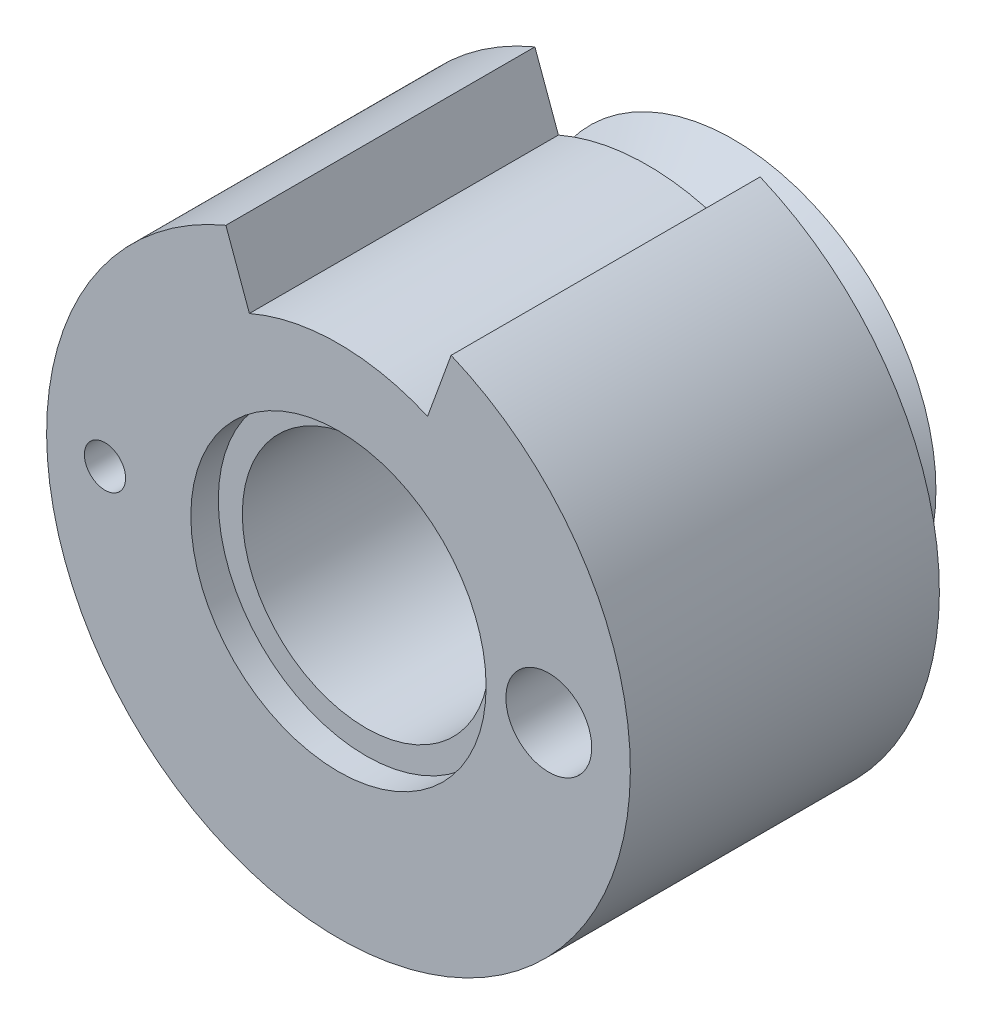
ISO-10303-21;
HEADER;
FILE_DESCRIPTION(('STEP AP214'),'2;1');
FILE_NAME('part.step','',(''),(''),'','','');
FILE_SCHEMA(('AUTOMOTIVE_DESIGN { 1 0 10303 214 1 1 1 1 }'));
ENDSEC;
DATA;
#1=APPLICATION_CONTEXT('core data for automotive mechanical design processes');
#2=APPLICATION_PROTOCOL_DEFINITION('international standard','automotive_design',2000,#1);
#3=PRODUCT_CONTEXT('',#1,'mechanical');
#4=PRODUCT('Part','Part','',(#3));
#5=PRODUCT_RELATED_PRODUCT_CATEGORY('part','',(#4));
#6=PRODUCT_DEFINITION_FORMATION('','',#4);
#7=PRODUCT_DEFINITION_CONTEXT('part definition',#1,'design');
#8=PRODUCT_DEFINITION('design','',#6,#7);
#9=PRODUCT_DEFINITION_SHAPE('','',#8);
#10=(LENGTH_UNIT() NAMED_UNIT(*) SI_UNIT(.MILLI.,.METRE.));
#11=(NAMED_UNIT(*) PLANE_ANGLE_UNIT() SI_UNIT($,.RADIAN.));
#12=(NAMED_UNIT(*) SI_UNIT($,.STERADIAN.) SOLID_ANGLE_UNIT());
#13=UNCERTAINTY_MEASURE_WITH_UNIT(LENGTH_MEASURE(1.E-05),#10,'distance_accuracy_value','');
#14=(GEOMETRIC_REPRESENTATION_CONTEXT(3) GLOBAL_UNCERTAINTY_ASSIGNED_CONTEXT((#13)) GLOBAL_UNIT_ASSIGNED_CONTEXT((#10,
#11,#12)) REPRESENTATION_CONTEXT('',''));
#15=CARTESIAN_POINT('',(0.,0.,0.));
#16=DIRECTION('',(0.,0.,1.));
#17=DIRECTION('',(1.,0.,0.));
#18=AXIS2_PLACEMENT_3D('',#15,#16,#17);
#19=CARTESIAN_POINT('',(0.,0.,0.));
#20=DIRECTION('',(0.,0.,1.));
#21=DIRECTION('',(1.,0.,0.));
#22=AXIS2_PLACEMENT_3D('',#19,#20,#21);
#23=PLANE('',#22);
#24=CARTESIAN_POINT('',(-6.8,0.,0.));
#25=DIRECTION('',(0.,0.,1.));
#26=DIRECTION('',(1.,0.,0.));
#27=AXIS2_PLACEMENT_3D('',#24,#25,#26);
#28=CIRCLE('',#27,0.6);
#29=CARTESIAN_POINT('',(-6.2,0.,0.));
#30=VERTEX_POINT('',#29);
#31=EDGE_CURVE('E136',#30,#30,#28,.T.);
#32=ORIENTED_EDGE('',*,*,#31,.T.);
#33=EDGE_LOOP('',(#32));
#34=FACE_BOUND('',#33,.T.);
#35=CARTESIAN_POINT('',(0.,0.,0.));
#36=DIRECTION('',(0.,0.,-1.));
#37=DIRECTION('',(-1.,0.,0.));
#38=AXIS2_PLACEMENT_3D('',#35,#36,#37);
#39=CIRCLE('',#38,5.9);
#40=CARTESIAN_POINT('',(5.77658163265306,-1.20046017897109,0.));
#41=VERTEX_POINT('',#40);
#42=CARTESIAN_POINT('',(5.77658163265306,1.20046017897109,0.));
#43=VERTEX_POINT('',#42);
#44=EDGE_CURVE('E54',#41,#43,#39,.T.);
#45=ORIENTED_EDGE('',*,*,#44,.F.);
#46=CARTESIAN_POINT('',(6.125,0.,0.));
#47=DIRECTION('',(0.,0.,1.));
#48=DIRECTION('',(1.,0.,0.));
#49=AXIS2_PLACEMENT_3D('',#46,#47,#48);
#50=CIRCLE('',#49,1.25);
#51=EDGE_CURVE('E135',#41,#43,#50,.T.);
#52=ORIENTED_EDGE('',*,*,#51,.T.);
#53=EDGE_LOOP('',(#45,#52));
#54=FACE_BOUND('',#53,.T.);
#55=CARTESIAN_POINT('',(0.,0.,0.));
#56=DIRECTION('',(0.,0.,1.));
#57=DIRECTION('',(1.,0.,0.));
#58=AXIS2_PLACEMENT_3D('',#55,#56,#57);
#59=CIRCLE('',#58,8.5);
#60=CARTESIAN_POINT('',(-3.27982746934026,7.8417301516541,0.));
#61=VERTEX_POINT('',#60);
#62=CARTESIAN_POINT('',(3.27982746934026,7.8417301516541,0.));
#63=VERTEX_POINT('',#62);
#64=EDGE_CURVE('E142',#61,#63,#59,.T.);
#65=ORIENTED_EDGE('',*,*,#64,.F.);
#66=DIRECTION('',(0.34202014332567,-0.939692620785908,0.));
#67=VECTOR('',#66,1.);
#68=CARTESIAN_POINT('',(-0.375877048314356,-0.136808057330266,0.));
#69=LINE('',#68,#67);
#70=CARTESIAN_POINT('',(-2.59479450837481,5.95961755981942,0.));
#71=VERTEX_POINT('',#70);
#72=EDGE_CURVE('E105',#61,#71,#69,.T.);
#73=ORIENTED_EDGE('',*,*,#72,.T.);
#74=CARTESIAN_POINT('',(0.,0.,0.));
#75=DIRECTION('',(0.,0.,1.));
#76=DIRECTION('',(1.,0.,0.));
#77=AXIS2_PLACEMENT_3D('',#74,#75,#76);
#78=CIRCLE('',#77,6.5);
#79=CARTESIAN_POINT('',(2.59479450837481,5.95961755981941,0.));
#80=VERTEX_POINT('',#79);
#81=EDGE_CURVE('E108',#71,#80,#78,.F.);
#82=ORIENTED_EDGE('',*,*,#81,.T.);
#83=DIRECTION('',(0.342020143325669,0.939692620785908,0.));
#84=VECTOR('',#83,1.);
#85=CARTESIAN_POINT('',(0.375877048314363,-0.136808057330268,0.));
#86=LINE('',#85,#84);
#87=EDGE_CURVE('E81',#80,#63,#86,.T.);
#88=ORIENTED_EDGE('',*,*,#87,.T.);
#89=EDGE_LOOP('',(#65,#73,#82,#88));
#90=FACE_BOUND('',#89,.T.);
#91=ADVANCED_FACE('F32',(#34,#54,#90),#23,.F.);
#92=CARTESIAN_POINT('',(0.,0.,9.));
#93=DIRECTION('',(0.,0.,-1.));
#94=DIRECTION('',(-1.,0.,0.));
#95=AXIS2_PLACEMENT_3D('',#92,#93,#94);
#96=CYLINDRICAL_SURFACE('',#95,3.6);
#97=CARTESIAN_POINT('',(0.,0.,8.2));
#98=DIRECTION('',(0.,0.,1.));
#99=DIRECTION('',(1.,0.,0.));
#100=AXIS2_PLACEMENT_3D('',#97,#98,#99);
#101=CIRCLE('',#100,3.6);
#102=CARTESIAN_POINT('',(3.6,0.,8.2));
#103=VERTEX_POINT('',#102);
#104=EDGE_CURVE('E129',#103,#103,#101,.T.);
#105=ORIENTED_EDGE('',*,*,#104,.T.);
#106=EDGE_LOOP('',(#105));
#107=FACE_BOUND('',#106,.T.);
#108=CARTESIAN_POINT('',(0.,0.,-1.7));
#109=DIRECTION('',(0.,0.,-1.));
#110=DIRECTION('',(-1.,0.,0.));
#111=AXIS2_PLACEMENT_3D('',#108,#109,#110);
#112=CIRCLE('',#111,3.6);
#113=CARTESIAN_POINT('',(-3.6,0.,-1.7));
#114=VERTEX_POINT('',#113);
#115=EDGE_CURVE('E114',#114,#114,#112,.T.);
#116=ORIENTED_EDGE('',*,*,#115,.T.);
#117=EDGE_LOOP('',(#116));
#118=FACE_BOUND('',#117,.T.);
#119=ADVANCED_FACE('F167',(#107,#118),#96,.F.);
#120=CARTESIAN_POINT('',(0.,0.,9.));
#121=DIRECTION('',(0.,0.,1.));
#122=DIRECTION('',(1.,0.,0.));
#123=AXIS2_PLACEMENT_3D('',#120,#121,#122);
#124=PLANE('',#123);
#125=DIRECTION('',(-0.34202014332567,0.939692620785908,0.));
#126=VECTOR('',#125,1.);
#127=CARTESIAN_POINT('',(-2.59479450837481,5.95961755981942,9.));
#128=LINE('',#127,#126);
#129=CARTESIAN_POINT('',(-2.59479450837481,5.95961755981942,9.));
#130=VERTEX_POINT('',#129);
#131=CARTESIAN_POINT('',(-3.27982746934026,7.8417301516541,9.));
#132=VERTEX_POINT('',#131);
#133=EDGE_CURVE('E85',#130,#132,#128,.T.);
#134=ORIENTED_EDGE('',*,*,#133,.T.);
#135=CARTESIAN_POINT('',(0.,0.,9.));
#136=DIRECTION('',(0.,0.,1.));
#137=DIRECTION('',(1.,0.,0.));
#138=AXIS2_PLACEMENT_3D('',#135,#136,#137);
#139=CIRCLE('',#138,8.5);
#140=CARTESIAN_POINT('',(3.27982746934026,7.8417301516541,9.));
#141=VERTEX_POINT('',#140);
#142=EDGE_CURVE('E99',#132,#141,#139,.T.);
#143=ORIENTED_EDGE('',*,*,#142,.T.);
#144=DIRECTION('',(-0.342020143325669,-0.939692620785908,0.));
#145=VECTOR('',#144,1.);
#146=CARTESIAN_POINT('',(3.41678043147576,8.21800532264882,9.));
#147=LINE('',#146,#145);
#148=CARTESIAN_POINT('',(2.59479450837481,5.95961755981941,9.));
#149=VERTEX_POINT('',#148);
#150=EDGE_CURVE('E47',#141,#149,#147,.T.);
#151=ORIENTED_EDGE('',*,*,#150,.T.);
#152=CARTESIAN_POINT('',(0.,0.,9.));
#153=DIRECTION('',(0.,0.,1.));
#154=DIRECTION('',(-1.,0.,0.));
#155=AXIS2_PLACEMENT_3D('',#152,#153,#154);
#156=CIRCLE('',#155,6.5);
#157=EDGE_CURVE('E88',#149,#130,#156,.T.);
#158=ORIENTED_EDGE('',*,*,#157,.T.);
#159=EDGE_LOOP('',(#134,#143,#151,#158));
#160=FACE_BOUND('',#159,.T.);
#161=CARTESIAN_POINT('',(0.,0.,9.));
#162=DIRECTION('',(0.,0.,1.));
#163=DIRECTION('',(1.,0.,0.));
#164=AXIS2_PLACEMENT_3D('',#161,#162,#163);
#165=CIRCLE('',#164,4.3);
#166=CARTESIAN_POINT('',(4.3,0.,9.));
#167=VERTEX_POINT('',#166);
#168=EDGE_CURVE('E125',#167,#167,#165,.T.);
#169=ORIENTED_EDGE('',*,*,#168,.F.);
#170=EDGE_LOOP('',(#169));
#171=FACE_BOUND('',#170,.T.);
#172=CARTESIAN_POINT('',(6.125,0.,9.));
#173=DIRECTION('',(0.,0.,1.));
#174=DIRECTION('',(1.,0.,0.));
#175=AXIS2_PLACEMENT_3D('',#172,#173,#174);
#176=CIRCLE('',#175,1.25);
#177=CARTESIAN_POINT('',(7.375,0.,9.));
#178=VERTEX_POINT('',#177);
#179=EDGE_CURVE('E139',#178,#178,#176,.T.);
#180=ORIENTED_EDGE('',*,*,#179,.F.);
#181=EDGE_LOOP('',(#180));
#182=FACE_BOUND('',#181,.T.);
#183=CARTESIAN_POINT('',(-6.8,0.,9.));
#184=DIRECTION('',(0.,0.,1.));
#185=DIRECTION('',(1.,0.,0.));
#186=AXIS2_PLACEMENT_3D('',#183,#184,#185);
#187=CIRCLE('',#186,0.6);
#188=CARTESIAN_POINT('',(-6.2,0.,9.));
#189=VERTEX_POINT('',#188);
#190=EDGE_CURVE('E132',#189,#189,#187,.T.);
#191=ORIENTED_EDGE('',*,*,#190,.F.);
#192=EDGE_LOOP('',(#191));
#193=FACE_BOUND('',#192,.T.);
#194=ADVANCED_FACE('F96',(#160,#171,#182,#193),#124,.T.);
#195=CARTESIAN_POINT('',(0.,0.,9.));
#196=DIRECTION('',(0.,0.,-1.));
#197=DIRECTION('',(-1.,0.,0.));
#198=AXIS2_PLACEMENT_3D('',#195,#196,#197);
#199=CYLINDRICAL_SURFACE('',#198,8.5);
#200=ORIENTED_EDGE('',*,*,#142,.F.);
#201=DIRECTION('',(0.,0.,-1.));
#202=VECTOR('',#201,1.);
#203=CARTESIAN_POINT('',(-3.27982746934026,7.8417301516541,9.));
#204=LINE('',#203,#202);
#205=EDGE_CURVE('E11',#132,#61,#204,.T.);
#206=ORIENTED_EDGE('',*,*,#205,.T.);
#207=ORIENTED_EDGE('',*,*,#64,.T.);
#208=DIRECTION('',(0.,0.,-1.));
#209=VECTOR('',#208,1.);
#210=CARTESIAN_POINT('',(3.27982746934026,7.8417301516541,9.));
#211=LINE('',#210,#209);
#212=EDGE_CURVE('E40',#63,#141,#211,.F.);
#213=ORIENTED_EDGE('',*,*,#212,.T.);
#214=EDGE_LOOP('',(#200,#206,#207,#213));
#215=FACE_BOUND('',#214,.T.);
#216=ADVANCED_FACE('F34',(#215),#199,.T.);
#217=CARTESIAN_POINT('',(6.125,0.,9.));
#218=DIRECTION('',(0.,0.,-1.));
#219=DIRECTION('',(-1.,0.,0.));
#220=AXIS2_PLACEMENT_3D('',#217,#218,#219);
#221=CYLINDRICAL_SURFACE('',#220,1.25);
#222=ORIENTED_EDGE('',*,*,#179,.T.);
#223=EDGE_LOOP('',(#222));
#224=FACE_BOUND('',#223,.T.);
#225=EDGE_CURVE('E143',#43,#41,#50,.T.);
#226=ORIENTED_EDGE('',*,*,#225,.F.);
#227=ORIENTED_EDGE('',*,*,#51,.F.);
#228=EDGE_LOOP('',(#226,#227));
#229=FACE_BOUND('',#228,.T.);
#230=ADVANCED_FACE('F178',(#224,#229),#221,.F.);
#231=CARTESIAN_POINT('',(-6.8,0.,9.));
#232=DIRECTION('',(0.,0.,-1.));
#233=DIRECTION('',(-1.,0.,0.));
#234=AXIS2_PLACEMENT_3D('',#231,#232,#233);
#235=CYLINDRICAL_SURFACE('',#234,0.6);
#236=ORIENTED_EDGE('',*,*,#190,.T.);
#237=EDGE_LOOP('',(#236));
#238=FACE_BOUND('',#237,.T.);
#239=ORIENTED_EDGE('',*,*,#31,.F.);
#240=EDGE_LOOP('',(#239));
#241=FACE_BOUND('',#240,.T.);
#242=ADVANCED_FACE('F181',(#238,#241),#235,.F.);
#243=CARTESIAN_POINT('',(0.,0.,8.2));
#244=DIRECTION('',(0.,0.,1.));
#245=DIRECTION('',(1.,0.,0.));
#246=AXIS2_PLACEMENT_3D('',#243,#244,#245);
#247=CYLINDRICAL_SURFACE('',#246,4.3);
#248=CARTESIAN_POINT('',(0.,0.,8.2));
#249=DIRECTION('',(0.,0.,1.));
#250=DIRECTION('',(1.,0.,0.));
#251=AXIS2_PLACEMENT_3D('',#248,#249,#250);
#252=CIRCLE('',#251,4.3);
#253=CARTESIAN_POINT('',(4.3,0.,8.2));
#254=VERTEX_POINT('',#253);
#255=EDGE_CURVE('E126',#254,#254,#252,.T.);
#256=ORIENTED_EDGE('',*,*,#255,.F.);
#257=EDGE_LOOP('',(#256));
#258=FACE_BOUND('',#257,.T.);
#259=ORIENTED_EDGE('',*,*,#168,.T.);
#260=EDGE_LOOP('',(#259));
#261=FACE_BOUND('',#260,.T.);
#262=ADVANCED_FACE('F185',(#258,#261),#247,.F.);
#263=CARTESIAN_POINT('',(0.,0.,8.2));
#264=DIRECTION('',(0.,0.,1.));
#265=DIRECTION('',(1.,0.,0.));
#266=AXIS2_PLACEMENT_3D('',#263,#264,#265);
#267=PLANE('',#266);
#268=ORIENTED_EDGE('',*,*,#104,.F.);
#269=EDGE_LOOP('',(#268));
#270=FACE_BOUND('',#269,.T.);
#271=ORIENTED_EDGE('',*,*,#255,.T.);
#272=EDGE_LOOP('',(#271));
#273=FACE_BOUND('',#272,.T.);
#274=ADVANCED_FACE('F189',(#270,#273),#267,.T.);
#275=CARTESIAN_POINT('',(0.,0.,0.));
#276=DIRECTION('',(0.,0.,-1.));
#277=DIRECTION('',(-1.,0.,0.));
#278=AXIS2_PLACEMENT_3D('',#275,#276,#277);
#279=PLANE('',#278);
#280=EDGE_CURVE('E123',#43,#41,#39,.T.);
#281=ORIENTED_EDGE('',*,*,#280,.F.);
#282=ORIENTED_EDGE('',*,*,#225,.T.);
#283=EDGE_LOOP('',(#281,#282));
#284=FACE_BOUND('',#283,.T.);
#285=ADVANCED_FACE('F193',(#284),#279,.F.);
#286=CARTESIAN_POINT('',(0.,0.,-2.5));
#287=DIRECTION('',(0.,0.,-1.));
#288=DIRECTION('',(-1.,0.,0.));
#289=AXIS2_PLACEMENT_3D('',#286,#287,#288);
#290=PLANE('',#289);
#291=CARTESIAN_POINT('',(0.,0.,-2.5));
#292=DIRECTION('',(0.,0.,-1.));
#293=DIRECTION('',(-1.,0.,0.));
#294=AXIS2_PLACEMENT_3D('',#291,#292,#293);
#295=CIRCLE('',#294,4.3);
#296=CARTESIAN_POINT('',(-4.3,0.,-2.5));
#297=VERTEX_POINT('',#296);
#298=EDGE_CURVE('E110',#297,#297,#295,.T.);
#299=ORIENTED_EDGE('',*,*,#298,.F.);
#300=EDGE_LOOP('',(#299));
#301=FACE_BOUND('',#300,.T.);
#302=CARTESIAN_POINT('',(0.,0.,-2.5));
#303=DIRECTION('',(0.,0.,1.));
#304=DIRECTION('',(1.,0.,0.));
#305=AXIS2_PLACEMENT_3D('',#302,#303,#304);
#306=CIRCLE('',#305,5.9);
#307=CARTESIAN_POINT('',(5.9,0.,-2.5));
#308=VERTEX_POINT('',#307);
#309=EDGE_CURVE('E117',#308,#308,#306,.T.);
#310=ORIENTED_EDGE('',*,*,#309,.F.);
#311=EDGE_LOOP('',(#310));
#312=FACE_BOUND('',#311,.T.);
#313=ADVANCED_FACE('F197',(#301,#312),#290,.T.);
#314=CARTESIAN_POINT('',(0.,0.,-1.25));
#315=DIRECTION('',(0.,0.,-1.));
#316=DIRECTION('',(-1.,0.,0.));
#317=AXIS2_PLACEMENT_3D('',#314,#315,#316);
#318=CONICAL_SURFACE('',#317,4.6,0.805003494254653);
#319=ORIENTED_EDGE('',*,*,#309,.T.);
#320=EDGE_LOOP('',(#319));
#321=FACE_BOUND('',#320,.T.);
#322=CARTESIAN_POINT('',(0.,0.,-1.25));
#323=DIRECTION('',(0.,0.,1.));
#324=DIRECTION('',(1.,0.,0.));
#325=AXIS2_PLACEMENT_3D('',#322,#323,#324);
#326=CIRCLE('',#325,4.6);
#327=CARTESIAN_POINT('',(4.6,0.,-1.25));
#328=VERTEX_POINT('',#327);
#329=EDGE_CURVE('E120',#328,#328,#326,.T.);
#330=ORIENTED_EDGE('',*,*,#329,.F.);
#331=EDGE_LOOP('',(#330));
#332=FACE_BOUND('',#331,.T.);
#333=ADVANCED_FACE('F201',(#321,#332),#318,.T.);
#334=CARTESIAN_POINT('',(0.,0.,0.));
#335=DIRECTION('',(0.,0.,1.));
#336=DIRECTION('',(1.,0.,0.));
#337=AXIS2_PLACEMENT_3D('',#334,#335,#336);
#338=CONICAL_SURFACE('',#337,5.9,0.805003494254653);
#339=ORIENTED_EDGE('',*,*,#329,.T.);
#340=EDGE_LOOP('',(#339));
#341=FACE_BOUND('',#340,.T.);
#342=ORIENTED_EDGE('',*,*,#44,.T.);
#343=ORIENTED_EDGE('',*,*,#280,.T.);
#344=EDGE_LOOP('',(#342,#343));
#345=FACE_BOUND('',#344,.T.);
#346=ADVANCED_FACE('F205',(#341,#345),#338,.T.);
#347=CARTESIAN_POINT('',(0.,0.,-1.7));
#348=DIRECTION('',(0.,0.,-1.));
#349=DIRECTION('',(-1.,0.,0.));
#350=AXIS2_PLACEMENT_3D('',#347,#348,#349);
#351=CYLINDRICAL_SURFACE('',#350,4.3);
#352=CARTESIAN_POINT('',(0.,0.,-1.7));
#353=DIRECTION('',(0.,0.,-1.));
#354=DIRECTION('',(-1.,0.,0.));
#355=AXIS2_PLACEMENT_3D('',#352,#353,#354);
#356=CIRCLE('',#355,4.3);
#357=CARTESIAN_POINT('',(-4.3,0.,-1.7));
#358=VERTEX_POINT('',#357);
#359=EDGE_CURVE('E111',#358,#358,#356,.T.);
#360=ORIENTED_EDGE('',*,*,#359,.F.);
#361=EDGE_LOOP('',(#360));
#362=FACE_BOUND('',#361,.T.);
#363=ORIENTED_EDGE('',*,*,#298,.T.);
#364=EDGE_LOOP('',(#363));
#365=FACE_BOUND('',#364,.T.);
#366=ADVANCED_FACE('F209',(#362,#365),#351,.F.);
#367=CARTESIAN_POINT('',(0.,0.,-1.7));
#368=DIRECTION('',(0.,0.,-1.));
#369=DIRECTION('',(-1.,0.,0.));
#370=AXIS2_PLACEMENT_3D('',#367,#368,#369);
#371=PLANE('',#370);
#372=ORIENTED_EDGE('',*,*,#115,.F.);
#373=EDGE_LOOP('',(#372));
#374=FACE_BOUND('',#373,.T.);
#375=ORIENTED_EDGE('',*,*,#359,.T.);
#376=EDGE_LOOP('',(#375));
#377=FACE_BOUND('',#376,.T.);
#378=ADVANCED_FACE('F164',(#374,#377),#371,.T.);
#379=CARTESIAN_POINT('',(0.,0.,9.));
#380=DIRECTION('',(0.,0.,-1.));
#381=DIRECTION('',(-1.,0.,0.));
#382=AXIS2_PLACEMENT_3D('',#379,#380,#381);
#383=CYLINDRICAL_SURFACE('',#382,6.5);
#384=DIRECTION('',(0.,0.,-1.));
#385=VECTOR('',#384,1.);
#386=CARTESIAN_POINT('',(-2.59479450837481,5.95961755981942,9.));
#387=LINE('',#386,#385);
#388=EDGE_CURVE('E84',#130,#71,#387,.T.);
#389=ORIENTED_EDGE('',*,*,#388,.F.);
#390=ORIENTED_EDGE('',*,*,#157,.F.);
#391=DIRECTION('',(0.,0.,-1.));
#392=VECTOR('',#391,1.);
#393=CARTESIAN_POINT('',(2.59479450837481,5.95961755981941,9.));
#394=LINE('',#393,#392);
#395=EDGE_CURVE('E77',#149,#80,#394,.T.);
#396=ORIENTED_EDGE('',*,*,#395,.T.);
#397=ORIENTED_EDGE('',*,*,#81,.F.);
#398=EDGE_LOOP('',(#389,#390,#396,#397));
#399=FACE_BOUND('',#398,.T.);
#400=ADVANCED_FACE('F89',(#399),#383,.T.);
#401=CARTESIAN_POINT('',(-2.59479450837481,5.95961755981942,9.));
#402=DIRECTION('',(-0.939692620785908,-0.34202014332567,0.));
#403=DIRECTION('',(0.34202014332567,-0.939692620785908,0.));
#404=AXIS2_PLACEMENT_3D('',#401,#402,#403);
#405=PLANE('',#404);
#406=ORIENTED_EDGE('',*,*,#205,.F.);
#407=ORIENTED_EDGE('',*,*,#133,.F.);
#408=ORIENTED_EDGE('',*,*,#388,.T.);
#409=ORIENTED_EDGE('',*,*,#72,.F.);
#410=EDGE_LOOP('',(#406,#407,#408,#409));
#411=FACE_BOUND('',#410,.T.);
#412=ADVANCED_FACE('F156',(#411),#405,.F.);
#413=CARTESIAN_POINT('',(3.41678043147576,8.21800532264882,9.));
#414=DIRECTION('',(0.939692620785908,-0.342020143325669,0.));
#415=DIRECTION('',(0.342020143325669,0.939692620785908,0.));
#416=AXIS2_PLACEMENT_3D('',#413,#414,#415);
#417=PLANE('',#416);
#418=ORIENTED_EDGE('',*,*,#395,.F.);
#419=ORIENTED_EDGE('',*,*,#150,.F.);
#420=ORIENTED_EDGE('',*,*,#212,.F.);
#421=ORIENTED_EDGE('',*,*,#87,.F.);
#422=EDGE_LOOP('',(#418,#419,#420,#421));
#423=FACE_BOUND('',#422,.T.);
#424=ADVANCED_FACE('F79',(#423),#417,.F.);
#425=CLOSED_SHELL('',(#91,#119,#194,#216,#230,#242,#262,#274,#285,#313,#333,#346,#366,#378,#400,
#412,#424));
#426=MANIFOLD_SOLID_BREP('B2',#425);
#427=ADVANCED_BREP_SHAPE_REPRESENTATION('',(#18,#426),#14);
#428=SHAPE_DEFINITION_REPRESENTATION(#9,#427);
ENDSEC;
END-ISO-10303-21;
